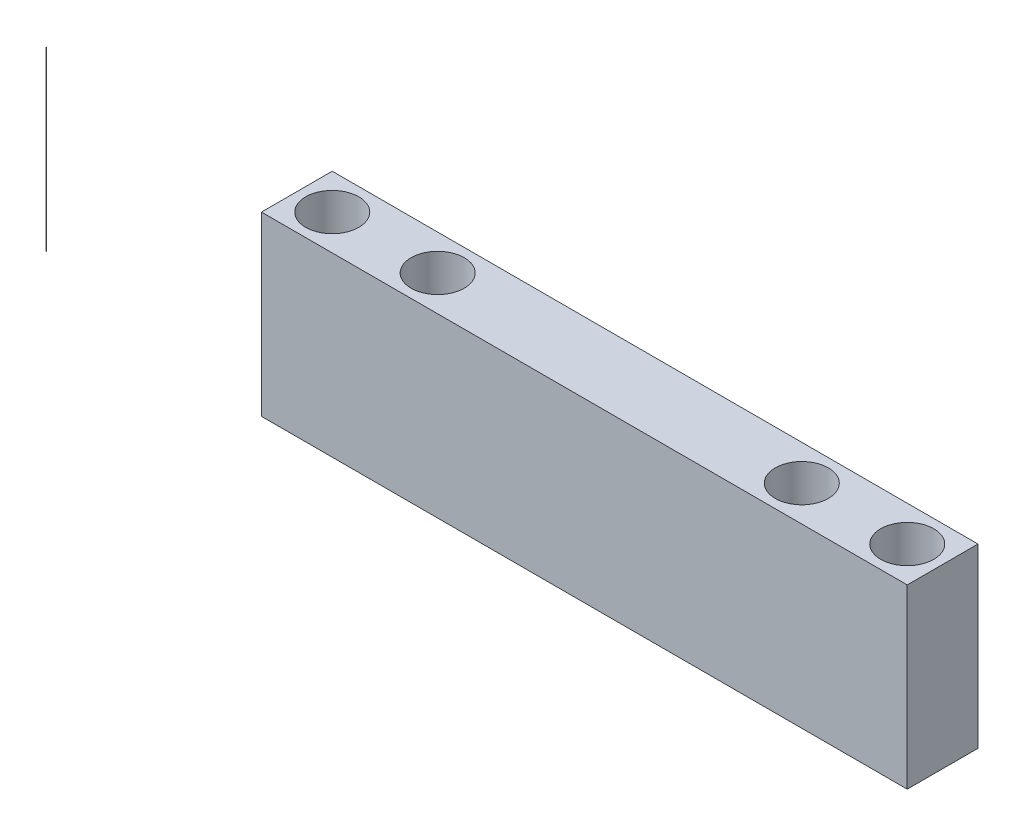
ISO-10303-21;
HEADER;
FILE_DESCRIPTION(('STEP AP214'),'2;1');
FILE_NAME('part.step','',(''),(''),'','','');
FILE_SCHEMA(('AUTOMOTIVE_DESIGN { 1 0 10303 214 1 1 1 1 }'));
ENDSEC;
DATA;
#1=APPLICATION_CONTEXT('core data for automotive mechanical design processes');
#2=APPLICATION_PROTOCOL_DEFINITION('international standard','automotive_design',2000,#1);
#3=PRODUCT_CONTEXT('',#1,'mechanical');
#4=PRODUCT('Part','Part','',(#3));
#5=PRODUCT_RELATED_PRODUCT_CATEGORY('part','',(#4));
#6=PRODUCT_DEFINITION_FORMATION('','',#4);
#7=PRODUCT_DEFINITION_CONTEXT('part definition',#1,'design');
#8=PRODUCT_DEFINITION('design','',#6,#7);
#9=PRODUCT_DEFINITION_SHAPE('','',#8);
#10=(LENGTH_UNIT() NAMED_UNIT(*) SI_UNIT(.MILLI.,.METRE.));
#11=(NAMED_UNIT(*) PLANE_ANGLE_UNIT() SI_UNIT($,.RADIAN.));
#12=(NAMED_UNIT(*) SI_UNIT($,.STERADIAN.) SOLID_ANGLE_UNIT());
#13=UNCERTAINTY_MEASURE_WITH_UNIT(LENGTH_MEASURE(1.E-05),#10,'distance_accuracy_value','');
#14=(GEOMETRIC_REPRESENTATION_CONTEXT(3) GLOBAL_UNCERTAINTY_ASSIGNED_CONTEXT((#13)) GLOBAL_UNIT_ASSIGNED_CONTEXT((#10,
#11,#12)) REPRESENTATION_CONTEXT('',''));
#15=CARTESIAN_POINT('',(0.,0.,0.));
#16=DIRECTION('',(0.,0.,1.));
#17=DIRECTION('',(1.,0.,0.));
#18=AXIS2_PLACEMENT_3D('',#15,#16,#17);
#19=CARTESIAN_POINT('',(-411.662010213321,127.,0.));
#20=DIRECTION('',(0.,-1.,0.));
#21=DIRECTION('',(0.,0.,-1.));
#22=AXIS2_PLACEMENT_3D('',#19,#20,#21);
#23=CYLINDRICAL_SURFACE('',#22,0.12903564619595);
#24=CARTESIAN_POINT('',(-411.662010213321,127.,0.));
#25=DIRECTION('',(0.,1.,0.));
#26=DIRECTION('',(0.,0.,1.));
#27=AXIS2_PLACEMENT_3D('',#24,#25,#26);
#28=CIRCLE('',#27,0.12903564619595);
#29=CARTESIAN_POINT('',(-411.662010213321,127.,0.129035646196001));
#30=VERTEX_POINT('',#29);
#31=EDGE_CURVE('E11',#30,#30,#28,.T.);
#32=ORIENTED_EDGE('',*,*,#31,.F.);
#33=EDGE_LOOP('',(#32));
#34=FACE_BOUND('',#33,.T.);
#35=CARTESIAN_POINT('',(-411.662010213321,0.,0.));
#36=DIRECTION('',(0.,1.,0.));
#37=DIRECTION('',(0.,0.,1.));
#38=AXIS2_PLACEMENT_3D('',#35,#36,#37);
#39=CIRCLE('',#38,0.12903564619595);
#40=CARTESIAN_POINT('',(-411.662010213321,0.,0.129035646196001));
#41=VERTEX_POINT('',#40);
#42=EDGE_CURVE('E45',#41,#41,#39,.T.);
#43=ORIENTED_EDGE('',*,*,#42,.T.);
#44=EDGE_LOOP('',(#43));
#45=FACE_BOUND('',#44,.T.);
#46=ADVANCED_FACE('F42',(#34,#45),#23,.T.);
#47=CARTESIAN_POINT('',(-411.662010213321,127.,0.));
#48=DIRECTION('',(0.,1.,0.));
#49=DIRECTION('',(0.,0.,1.));
#50=AXIS2_PLACEMENT_3D('',#47,#48,#49);
#51=PLANE('',#50);
#52=ORIENTED_EDGE('',*,*,#31,.T.);
#53=EDGE_LOOP('',(#52));
#54=FACE_BOUND('',#53,.T.);
#55=ADVANCED_FACE('F57',(#54),#51,.T.);
#56=CARTESIAN_POINT('',(-411.662010213321,0.,0.));
#57=DIRECTION('',(0.,1.,0.));
#58=DIRECTION('',(0.,0.,1.));
#59=AXIS2_PLACEMENT_3D('',#56,#57,#58);
#60=PLANE('',#59);
#61=ORIENTED_EDGE('',*,*,#42,.F.);
#62=EDGE_LOOP('',(#61));
#63=FACE_BOUND('',#62,.T.);
#64=ADVANCED_FACE('F55',(#63),#60,.F.);
#65=CLOSED_SHELL('',(#46,#55,#64));
#66=MANIFOLD_SOLID_BREP('B2',#65);
#67=CARTESIAN_POINT('',(0.,127.,0.));
#68=DIRECTION('',(0.,-1.,0.));
#69=DIRECTION('',(0.,0.,-1.));
#70=AXIS2_PLACEMENT_3D('',#67,#68,#69);
#71=PLANE('',#70);
#72=DIRECTION('',(0.,0.,-1.));
#73=VECTOR('',#72,1.);
#74=CARTESIAN_POINT('',(231.775,127.,25.4000000000001));
#75=LINE('',#74,#73);
#76=CARTESIAN_POINT('',(231.775,127.,25.4000000000001));
#77=VERTEX_POINT('',#76);
#78=CARTESIAN_POINT('',(231.775,127.,-25.4000000000001));
#79=VERTEX_POINT('',#78);
#80=EDGE_CURVE('E134',#77,#79,#75,.T.);
#81=ORIENTED_EDGE('',*,*,#80,.T.);
#82=DIRECTION('',(-1.,0.,0.));
#83=VECTOR('',#82,1.);
#84=CARTESIAN_POINT('',(-231.775,127.,-25.3999999999999));
#85=LINE('',#84,#83);
#86=CARTESIAN_POINT('',(-231.775,127.,-25.3999999999999));
#87=VERTEX_POINT('',#86);
#88=EDGE_CURVE('E129',#79,#87,#85,.T.);
#89=ORIENTED_EDGE('',*,*,#88,.T.);
#90=DIRECTION('',(0.,0.,1.));
#91=VECTOR('',#90,1.);
#92=CARTESIAN_POINT('',(-231.775,127.,25.4000000000001));
#93=LINE('',#92,#91);
#94=CARTESIAN_POINT('',(-231.775,127.,25.4000000000001));
#95=VERTEX_POINT('',#94);
#96=EDGE_CURVE('E132',#87,#95,#93,.T.);
#97=ORIENTED_EDGE('',*,*,#96,.T.);
#98=DIRECTION('',(1.,0.,0.));
#99=VECTOR('',#98,1.);
#100=CARTESIAN_POINT('',(-231.775,127.,25.4000000000001));
#101=LINE('',#100,#99);
#102=EDGE_CURVE('E99',#95,#77,#101,.T.);
#103=ORIENTED_EDGE('',*,*,#102,.T.);
#104=EDGE_LOOP('',(#81,#89,#97,#103));
#105=FACE_BOUND('',#104,.T.);
#106=CARTESIAN_POINT('',(206.375,127.,0.));
#107=DIRECTION('',(0.,1.,0.));
#108=DIRECTION('',(0.,0.,1.));
#109=AXIS2_PLACEMENT_3D('',#106,#107,#108);
#110=CIRCLE('',#109,19.05);
#111=CARTESIAN_POINT('',(206.375,127.,19.05));
#112=VERTEX_POINT('',#111);
#113=EDGE_CURVE('E149',#112,#112,#110,.T.);
#114=ORIENTED_EDGE('',*,*,#113,.F.);
#115=EDGE_LOOP('',(#114));
#116=FACE_BOUND('',#115,.T.);
#117=CARTESIAN_POINT('',(-206.375,127.,0.));
#118=DIRECTION('',(0.,1.,0.));
#119=DIRECTION('',(0.,0.,1.));
#120=AXIS2_PLACEMENT_3D('',#117,#118,#119);
#121=CIRCLE('',#120,19.05);
#122=CARTESIAN_POINT('',(-206.375,127.,19.05));
#123=VERTEX_POINT('',#122);
#124=EDGE_CURVE('E164',#123,#123,#121,.T.);
#125=ORIENTED_EDGE('',*,*,#124,.F.);
#126=EDGE_LOOP('',(#125));
#127=FACE_BOUND('',#126,.T.);
#128=CARTESIAN_POINT('',(130.683,127.,0.));
#129=DIRECTION('',(0.,1.,0.));
#130=DIRECTION('',(0.,0.,1.));
#131=AXIS2_PLACEMENT_3D('',#128,#129,#130);
#132=CIRCLE('',#131,19.05);
#133=CARTESIAN_POINT('',(130.683,127.,19.05));
#134=VERTEX_POINT('',#133);
#135=EDGE_CURVE('E170',#134,#134,#132,.T.);
#136=ORIENTED_EDGE('',*,*,#135,.F.);
#137=EDGE_LOOP('',(#136));
#138=FACE_BOUND('',#137,.T.);
#139=CARTESIAN_POINT('',(-130.683,127.,0.));
#140=DIRECTION('',(0.,1.,0.));
#141=DIRECTION('',(0.,0.,1.));
#142=AXIS2_PLACEMENT_3D('',#139,#140,#141);
#143=CIRCLE('',#142,19.05);
#144=CARTESIAN_POINT('',(-130.683,127.,19.05));
#145=VERTEX_POINT('',#144);
#146=EDGE_CURVE('E176',#145,#145,#143,.T.);
#147=ORIENTED_EDGE('',*,*,#146,.F.);
#148=EDGE_LOOP('',(#147));
#149=FACE_BOUND('',#148,.T.);
#150=ADVANCED_FACE('F82',(#105,#116,#127,#138,#149),#71,.F.);
#151=CARTESIAN_POINT('',(0.,0.,0.));
#152=DIRECTION('',(0.,-1.,0.));
#153=DIRECTION('',(0.,0.,-1.));
#154=AXIS2_PLACEMENT_3D('',#151,#152,#153);
#155=PLANE('',#154);
#156=CARTESIAN_POINT('',(130.683,0.,0.));
#157=DIRECTION('',(0.,1.,0.));
#158=DIRECTION('',(0.,0.,1.));
#159=AXIS2_PLACEMENT_3D('',#156,#157,#158);
#160=CIRCLE('',#159,19.05);
#161=CARTESIAN_POINT('',(130.683,0.,19.05));
#162=VERTEX_POINT('',#161);
#163=EDGE_CURVE('E173',#162,#162,#160,.T.);
#164=ORIENTED_EDGE('',*,*,#163,.T.);
#165=EDGE_LOOP('',(#164));
#166=FACE_BOUND('',#165,.T.);
#167=CARTESIAN_POINT('',(206.375,0.,0.));
#168=DIRECTION('',(0.,1.,0.));
#169=DIRECTION('',(0.,0.,1.));
#170=AXIS2_PLACEMENT_3D('',#167,#168,#169);
#171=CIRCLE('',#170,19.05);
#172=CARTESIAN_POINT('',(206.375,0.,19.05));
#173=VERTEX_POINT('',#172);
#174=EDGE_CURVE('E161',#173,#173,#171,.T.);
#175=ORIENTED_EDGE('',*,*,#174,.T.);
#176=EDGE_LOOP('',(#175));
#177=FACE_BOUND('',#176,.T.);
#178=DIRECTION('',(0.,0.,-1.));
#179=VECTOR('',#178,1.);
#180=CARTESIAN_POINT('',(231.775,0.,25.4000000000001));
#181=LINE('',#180,#179);
#182=CARTESIAN_POINT('',(231.775,0.,25.4000000000001));
#183=VERTEX_POINT('',#182);
#184=CARTESIAN_POINT('',(231.775,0.,-25.4000000000001));
#185=VERTEX_POINT('',#184);
#186=EDGE_CURVE('E146',#183,#185,#181,.T.);
#187=ORIENTED_EDGE('',*,*,#186,.F.);
#188=DIRECTION('',(1.,0.,0.));
#189=VECTOR('',#188,1.);
#190=CARTESIAN_POINT('',(-231.775,0.,25.4000000000001));
#191=LINE('',#190,#189);
#192=CARTESIAN_POINT('',(-231.775,0.,25.4000000000001));
#193=VERTEX_POINT('',#192);
#194=EDGE_CURVE('E122',#193,#183,#191,.T.);
#195=ORIENTED_EDGE('',*,*,#194,.F.);
#196=DIRECTION('',(0.,0.,1.));
#197=VECTOR('',#196,1.);
#198=CARTESIAN_POINT('',(-231.775,0.,25.4000000000001));
#199=LINE('',#198,#197);
#200=CARTESIAN_POINT('',(-231.775,0.,-25.3999999999999));
#201=VERTEX_POINT('',#200);
#202=EDGE_CURVE('E116',#201,#193,#199,.T.);
#203=ORIENTED_EDGE('',*,*,#202,.F.);
#204=DIRECTION('',(-1.,0.,0.));
#205=VECTOR('',#204,1.);
#206=CARTESIAN_POINT('',(-231.775,0.,-25.3999999999999));
#207=LINE('',#206,#205);
#208=EDGE_CURVE('E138',#185,#201,#207,.T.);
#209=ORIENTED_EDGE('',*,*,#208,.F.);
#210=EDGE_LOOP('',(#187,#195,#203,#209));
#211=FACE_BOUND('',#210,.T.);
#212=CARTESIAN_POINT('',(-206.375,0.,0.));
#213=DIRECTION('',(0.,1.,0.));
#214=DIRECTION('',(0.,0.,1.));
#215=AXIS2_PLACEMENT_3D('',#212,#213,#214);
#216=CIRCLE('',#215,19.05);
#217=CARTESIAN_POINT('',(-206.375,0.,19.05));
#218=VERTEX_POINT('',#217);
#219=EDGE_CURVE('E167',#218,#218,#216,.T.);
#220=ORIENTED_EDGE('',*,*,#219,.T.);
#221=EDGE_LOOP('',(#220));
#222=FACE_BOUND('',#221,.T.);
#223=CARTESIAN_POINT('',(-130.683,0.,0.));
#224=DIRECTION('',(0.,1.,0.));
#225=DIRECTION('',(0.,0.,1.));
#226=AXIS2_PLACEMENT_3D('',#223,#224,#225);
#227=CIRCLE('',#226,19.05);
#228=CARTESIAN_POINT('',(-130.683,0.,19.05));
#229=VERTEX_POINT('',#228);
#230=EDGE_CURVE('E179',#229,#229,#227,.T.);
#231=ORIENTED_EDGE('',*,*,#230,.T.);
#232=EDGE_LOOP('',(#231));
#233=FACE_BOUND('',#232,.T.);
#234=ADVANCED_FACE('F157',(#166,#177,#211,#222,#233),#155,.T.);
#235=CARTESIAN_POINT('',(231.775,127.,25.4000000000001));
#236=DIRECTION('',(-1.,0.,0.));
#237=DIRECTION('',(0.,0.,1.));
#238=AXIS2_PLACEMENT_3D('',#235,#236,#237);
#239=PLANE('',#238);
#240=ORIENTED_EDGE('',*,*,#186,.T.);
#241=DIRECTION('',(0.,-1.,0.));
#242=VECTOR('',#241,1.);
#243=CARTESIAN_POINT('',(231.775,127.,-25.4000000000001));
#244=LINE('',#243,#242);
#245=EDGE_CURVE('E40',#79,#185,#244,.T.);
#246=ORIENTED_EDGE('',*,*,#245,.F.);
#247=ORIENTED_EDGE('',*,*,#80,.F.);
#248=DIRECTION('',(0.,-1.,0.));
#249=VECTOR('',#248,1.);
#250=CARTESIAN_POINT('',(231.775,127.,25.4000000000001));
#251=LINE('',#250,#249);
#252=EDGE_CURVE('E142',#77,#183,#251,.T.);
#253=ORIENTED_EDGE('',*,*,#252,.T.);
#254=EDGE_LOOP('',(#240,#246,#247,#253));
#255=FACE_BOUND('',#254,.T.);
#256=ADVANCED_FACE('F84',(#255),#239,.F.);
#257=CARTESIAN_POINT('',(-231.775,127.,-25.3999999999999));
#258=DIRECTION('',(0.,0.,1.));
#259=DIRECTION('',(1.,0.,0.));
#260=AXIS2_PLACEMENT_3D('',#257,#258,#259);
#261=PLANE('',#260);
#262=ORIENTED_EDGE('',*,*,#208,.T.);
#263=DIRECTION('',(0.,-1.,0.));
#264=VECTOR('',#263,1.);
#265=CARTESIAN_POINT('',(-231.775,127.,-25.3999999999999));
#266=LINE('',#265,#264);
#267=EDGE_CURVE('E91',#87,#201,#266,.T.);
#268=ORIENTED_EDGE('',*,*,#267,.F.);
#269=ORIENTED_EDGE('',*,*,#88,.F.);
#270=ORIENTED_EDGE('',*,*,#245,.T.);
#271=EDGE_LOOP('',(#262,#268,#269,#270));
#272=FACE_BOUND('',#271,.T.);
#273=ADVANCED_FACE('F137',(#272),#261,.F.);
#274=CARTESIAN_POINT('',(-231.775,127.,25.4000000000001));
#275=DIRECTION('',(1.,0.,0.));
#276=DIRECTION('',(0.,0.,-1.));
#277=AXIS2_PLACEMENT_3D('',#274,#275,#276);
#278=PLANE('',#277);
#279=ORIENTED_EDGE('',*,*,#202,.T.);
#280=DIRECTION('',(0.,-1.,0.));
#281=VECTOR('',#280,1.);
#282=CARTESIAN_POINT('',(-231.775,127.,25.4000000000001));
#283=LINE('',#282,#281);
#284=EDGE_CURVE('E139',#95,#193,#283,.T.);
#285=ORIENTED_EDGE('',*,*,#284,.F.);
#286=ORIENTED_EDGE('',*,*,#96,.F.);
#287=ORIENTED_EDGE('',*,*,#267,.T.);
#288=EDGE_LOOP('',(#279,#285,#286,#287));
#289=FACE_BOUND('',#288,.T.);
#290=ADVANCED_FACE('F140',(#289),#278,.F.);
#291=CARTESIAN_POINT('',(-231.775,127.,25.4000000000001));
#292=DIRECTION('',(0.,0.,-1.));
#293=DIRECTION('',(-1.,0.,0.));
#294=AXIS2_PLACEMENT_3D('',#291,#292,#293);
#295=PLANE('',#294);
#296=ORIENTED_EDGE('',*,*,#194,.T.);
#297=ORIENTED_EDGE('',*,*,#252,.F.);
#298=ORIENTED_EDGE('',*,*,#102,.F.);
#299=ORIENTED_EDGE('',*,*,#284,.T.);
#300=EDGE_LOOP('',(#296,#297,#298,#299));
#301=FACE_BOUND('',#300,.T.);
#302=ADVANCED_FACE('F154',(#301),#295,.F.);
#303=CARTESIAN_POINT('',(206.375,127.,0.));
#304=DIRECTION('',(0.,-1.,0.));
#305=DIRECTION('',(0.,0.,-1.));
#306=AXIS2_PLACEMENT_3D('',#303,#304,#305);
#307=CYLINDRICAL_SURFACE('',#306,19.05);
#308=ORIENTED_EDGE('',*,*,#113,.T.);
#309=EDGE_LOOP('',(#308));
#310=FACE_BOUND('',#309,.T.);
#311=ORIENTED_EDGE('',*,*,#174,.F.);
#312=EDGE_LOOP('',(#311));
#313=FACE_BOUND('',#312,.T.);
#314=ADVANCED_FACE('F196',(#310,#313),#307,.F.);
#315=CARTESIAN_POINT('',(-206.375,127.,0.));
#316=DIRECTION('',(0.,-1.,0.));
#317=DIRECTION('',(0.,0.,-1.));
#318=AXIS2_PLACEMENT_3D('',#315,#316,#317);
#319=CYLINDRICAL_SURFACE('',#318,19.05);
#320=ORIENTED_EDGE('',*,*,#124,.T.);
#321=EDGE_LOOP('',(#320));
#322=FACE_BOUND('',#321,.T.);
#323=ORIENTED_EDGE('',*,*,#219,.F.);
#324=EDGE_LOOP('',(#323));
#325=FACE_BOUND('',#324,.T.);
#326=ADVANCED_FACE('F242',(#322,#325),#319,.F.);
#327=CARTESIAN_POINT('',(130.683,127.,0.));
#328=DIRECTION('',(0.,-1.,0.));
#329=DIRECTION('',(0.,0.,-1.));
#330=AXIS2_PLACEMENT_3D('',#327,#328,#329);
#331=CYLINDRICAL_SURFACE('',#330,19.05);
#332=ORIENTED_EDGE('',*,*,#135,.T.);
#333=EDGE_LOOP('',(#332));
#334=FACE_BOUND('',#333,.T.);
#335=ORIENTED_EDGE('',*,*,#163,.F.);
#336=EDGE_LOOP('',(#335));
#337=FACE_BOUND('',#336,.T.);
#338=ADVANCED_FACE('F250',(#334,#337),#331,.F.);
#339=CARTESIAN_POINT('',(-130.683,127.,0.));
#340=DIRECTION('',(0.,-1.,0.));
#341=DIRECTION('',(0.,0.,-1.));
#342=AXIS2_PLACEMENT_3D('',#339,#340,#341);
#343=CYLINDRICAL_SURFACE('',#342,19.05);
#344=ORIENTED_EDGE('',*,*,#146,.T.);
#345=EDGE_LOOP('',(#344));
#346=FACE_BOUND('',#345,.T.);
#347=ORIENTED_EDGE('',*,*,#230,.F.);
#348=EDGE_LOOP('',(#347));
#349=FACE_BOUND('',#348,.T.);
#350=ADVANCED_FACE('F185',(#346,#349),#343,.F.);
#351=CLOSED_SHELL('',(#150,#234,#256,#273,#290,#302,#314,#326,#338,#350));
#352=MANIFOLD_SOLID_BREP('B6',#351);
#353=ADVANCED_BREP_SHAPE_REPRESENTATION('',(#18,#66,#352),#14);
#354=SHAPE_DEFINITION_REPRESENTATION(#9,#353);
ENDSEC;
END-ISO-10303-21;
